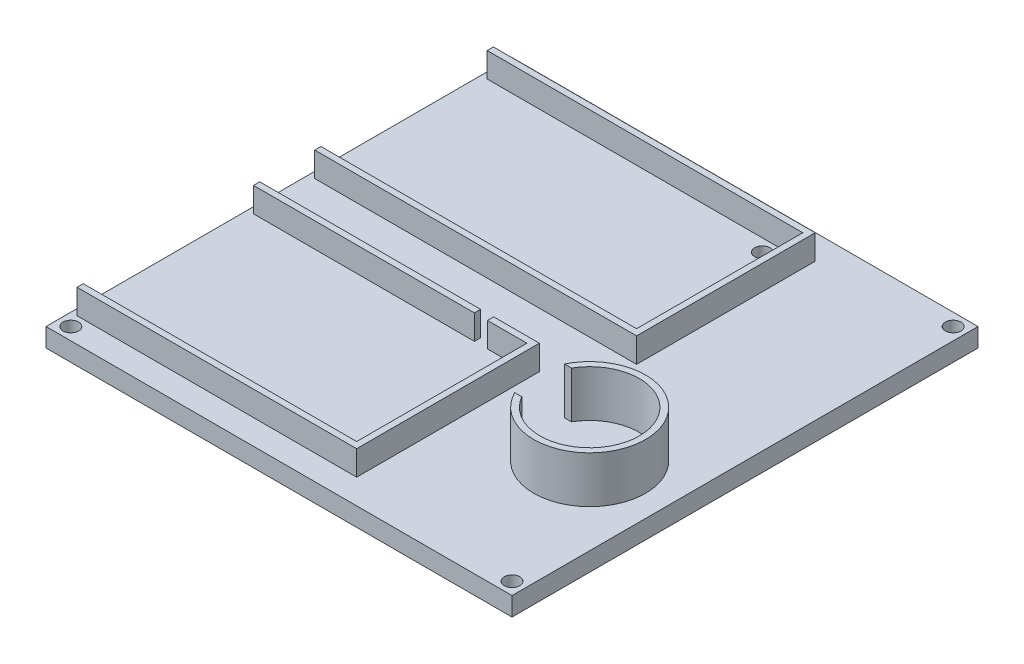
ISO-10303-21;
HEADER;
FILE_DESCRIPTION(('STEP AP214'),'2;1');
FILE_NAME('part.step','',(''),(''),'','','');
FILE_SCHEMA(('AUTOMOTIVE_DESIGN { 1 0 10303 214 1 1 1 1 }'));
ENDSEC;
DATA;
#1=APPLICATION_CONTEXT('core data for automotive mechanical design processes');
#2=APPLICATION_PROTOCOL_DEFINITION('international standard','automotive_design',2000,#1);
#3=PRODUCT_CONTEXT('',#1,'mechanical');
#4=PRODUCT('Part','Part','',(#3));
#5=PRODUCT_RELATED_PRODUCT_CATEGORY('part','',(#4));
#6=PRODUCT_DEFINITION_FORMATION('','',#4);
#7=PRODUCT_DEFINITION_CONTEXT('part definition',#1,'design');
#8=PRODUCT_DEFINITION('design','',#6,#7);
#9=PRODUCT_DEFINITION_SHAPE('','',#8);
#10=(LENGTH_UNIT() NAMED_UNIT(*) SI_UNIT(.MILLI.,.METRE.));
#11=(NAMED_UNIT(*) PLANE_ANGLE_UNIT() SI_UNIT($,.RADIAN.));
#12=(NAMED_UNIT(*) SI_UNIT($,.STERADIAN.) SOLID_ANGLE_UNIT());
#13=UNCERTAINTY_MEASURE_WITH_UNIT(LENGTH_MEASURE(1.E-05),#10,'distance_accuracy_value','');
#14=(GEOMETRIC_REPRESENTATION_CONTEXT(3) GLOBAL_UNCERTAINTY_ASSIGNED_CONTEXT((#13)) GLOBAL_UNIT_ASSIGNED_CONTEXT((#10,
#11,#12)) REPRESENTATION_CONTEXT('',''));
#15=CARTESIAN_POINT('',(0.,0.,0.));
#16=DIRECTION('',(0.,0.,1.));
#17=DIRECTION('',(1.,0.,0.));
#18=AXIS2_PLACEMENT_3D('',#15,#16,#17);
#19=CARTESIAN_POINT('',(50.,13.94,25.));
#20=DIRECTION('',(0.,-1.,0.));
#21=DIRECTION('',(0.,0.,-1.));
#22=AXIS2_PLACEMENT_3D('',#19,#20,#21);
#23=CYLINDRICAL_SURFACE('',#22,18.);
#24=DIRECTION('',(0.,1.,0.));
#25=VECTOR('',#24,1.);
#26=CARTESIAN_POINT('',(33.8754845034029,-10.5278361384715,17.));
#27=LINE('',#26,#25);
#28=CARTESIAN_POINT('',(33.8754845034029,6.,17.));
#29=VERTEX_POINT('',#28);
#30=CARTESIAN_POINT('',(33.8754845034029,21.,17.));
#31=VERTEX_POINT('',#30);
#32=EDGE_CURVE('E295',#29,#31,#27,.T.);
#33=ORIENTED_EDGE('',*,*,#32,.T.);
#34=CARTESIAN_POINT('',(50.,21.,25.));
#35=DIRECTION('',(0.,1.,0.));
#36=DIRECTION('',(0.,0.,1.));
#37=AXIS2_PLACEMENT_3D('',#34,#35,#36);
#38=CIRCLE('',#37,18.);
#39=CARTESIAN_POINT('',(33.8754845034029,21.,33.));
#40=VERTEX_POINT('',#39);
#41=EDGE_CURVE('E288',#40,#31,#38,.T.);
#42=ORIENTED_EDGE('',*,*,#41,.F.);
#43=DIRECTION('',(0.,1.,0.));
#44=VECTOR('',#43,1.);
#45=CARTESIAN_POINT('',(33.8754845034029,-10.5278361384715,33.));
#46=LINE('',#45,#44);
#47=CARTESIAN_POINT('',(33.8754845034029,6.,33.));
#48=VERTEX_POINT('',#47);
#49=EDGE_CURVE('E271',#48,#40,#46,.T.);
#50=ORIENTED_EDGE('',*,*,#49,.F.);
#51=CARTESIAN_POINT('',(50.,6.,25.));
#52=DIRECTION('',(0.,1.,0.));
#53=DIRECTION('',(0.,0.,1.));
#54=AXIS2_PLACEMENT_3D('',#51,#52,#53);
#55=CIRCLE('',#54,18.);
#56=EDGE_CURVE('E297',#48,#29,#55,.T.);
#57=ORIENTED_EDGE('',*,*,#56,.T.);
#58=EDGE_LOOP('',(#33,#42,#50,#57));
#59=FACE_BOUND('',#58,.T.);
#60=ADVANCED_FACE('F83',(#59),#23,.T.);
#61=CARTESIAN_POINT('',(50.,21.,25.));
#62=DIRECTION('',(0.,1.,0.));
#63=DIRECTION('',(0.,0.,1.));
#64=AXIS2_PLACEMENT_3D('',#61,#62,#63);
#65=PLANE('',#64);
#66=ORIENTED_EDGE('',*,*,#41,.T.);
#67=DIRECTION('',(1.,0.,0.));
#68=VECTOR('',#67,1.);
#69=CARTESIAN_POINT('',(0.,21.,17.));
#70=LINE('',#69,#68);
#71=CARTESIAN_POINT('',(36.143593539449,21.,17.));
#72=VERTEX_POINT('',#71);
#73=EDGE_CURVE('E281',#31,#72,#70,.T.);
#74=ORIENTED_EDGE('',*,*,#73,.T.);
#75=CARTESIAN_POINT('',(50.,21.,25.));
#76=DIRECTION('',(0.,1.,0.));
#77=DIRECTION('',(0.,0.,1.));
#78=AXIS2_PLACEMENT_3D('',#75,#76,#77);
#79=CIRCLE('',#78,16.);
#80=CARTESIAN_POINT('',(36.143593539449,21.,33.));
#81=VERTEX_POINT('',#80);
#82=EDGE_CURVE('E290',#81,#72,#79,.T.);
#83=ORIENTED_EDGE('',*,*,#82,.F.);
#84=DIRECTION('',(1.,0.,0.));
#85=VECTOR('',#84,1.);
#86=CARTESIAN_POINT('',(0.,21.,33.));
#87=LINE('',#86,#85);
#88=EDGE_CURVE('E274',#40,#81,#87,.T.);
#89=ORIENTED_EDGE('',*,*,#88,.F.);
#90=EDGE_LOOP('',(#66,#74,#83,#89));
#91=FACE_BOUND('',#90,.T.);
#92=ADVANCED_FACE('F286',(#91),#65,.T.);
#93=CARTESIAN_POINT('',(50.,13.94,25.));
#94=DIRECTION('',(0.,-1.,0.));
#95=DIRECTION('',(0.,0.,-1.));
#96=AXIS2_PLACEMENT_3D('',#93,#94,#95);
#97=CYLINDRICAL_SURFACE('',#96,16.);
#98=ORIENTED_EDGE('',*,*,#82,.T.);
#99=DIRECTION('',(0.,1.,0.));
#100=VECTOR('',#99,1.);
#101=CARTESIAN_POINT('',(36.143593539449,-10.5278361384715,17.));
#102=LINE('',#101,#100);
#103=CARTESIAN_POINT('',(36.143593539449,6.,17.));
#104=VERTEX_POINT('',#103);
#105=EDGE_CURVE('E924',#104,#72,#102,.T.);
#106=ORIENTED_EDGE('',*,*,#105,.F.);
#107=CARTESIAN_POINT('',(50.,6.,25.));
#108=DIRECTION('',(0.,1.,0.));
#109=DIRECTION('',(0.,0.,1.));
#110=AXIS2_PLACEMENT_3D('',#107,#108,#109);
#111=CIRCLE('',#110,16.);
#112=CARTESIAN_POINT('',(36.143593539449,6.,33.));
#113=VERTEX_POINT('',#112);
#114=EDGE_CURVE('E12',#104,#113,#111,.F.);
#115=ORIENTED_EDGE('',*,*,#114,.T.);
#116=DIRECTION('',(0.,1.,0.));
#117=VECTOR('',#116,1.);
#118=CARTESIAN_POINT('',(36.143593539449,-10.5278361384715,33.));
#119=LINE('',#118,#117);
#120=EDGE_CURVE('E280',#113,#81,#119,.T.);
#121=ORIENTED_EDGE('',*,*,#120,.T.);
#122=EDGE_LOOP('',(#98,#106,#115,#121));
#123=FACE_BOUND('',#122,.T.);
#124=ADVANCED_FACE('F596',(#123),#97,.F.);
#125=CARTESIAN_POINT('',(-75.,6.,-75.));
#126=DIRECTION('',(1.,0.,0.));
#127=DIRECTION('',(0.,0.,-1.));
#128=AXIS2_PLACEMENT_3D('',#125,#126,#127);
#129=PLANE('',#128);
#130=DIRECTION('',(0.,0.,1.));
#131=VECTOR('',#130,1.);
#132=CARTESIAN_POINT('',(-75.,0.,-75.));
#133=LINE('',#132,#131);
#134=CARTESIAN_POINT('',(-75.,0.,-75.));
#135=VERTEX_POINT('',#134);
#136=CARTESIAN_POINT('',(-75.,0.,75.));
#137=VERTEX_POINT('',#136);
#138=EDGE_CURVE('E514',#135,#137,#133,.T.);
#139=ORIENTED_EDGE('',*,*,#138,.T.);
#140=DIRECTION('',(0.,-1.,0.));
#141=VECTOR('',#140,1.);
#142=CARTESIAN_POINT('',(-75.,6.,75.));
#143=LINE('',#142,#141);
#144=CARTESIAN_POINT('',(-75.,6.,75.));
#145=VERTEX_POINT('',#144);
#146=EDGE_CURVE('E92',#145,#137,#143,.T.);
#147=ORIENTED_EDGE('',*,*,#146,.F.);
#148=DIRECTION('',(0.,0.,1.));
#149=VECTOR('',#148,1.);
#150=CARTESIAN_POINT('',(-75.,6.,-75.));
#151=LINE('',#150,#149);
#152=CARTESIAN_POINT('',(-75.,6.,-75.));
#153=VERTEX_POINT('',#152);
#154=EDGE_CURVE('E515',#153,#145,#151,.T.);
#155=ORIENTED_EDGE('',*,*,#154,.F.);
#156=DIRECTION('',(0.,-1.,0.));
#157=VECTOR('',#156,1.);
#158=CARTESIAN_POINT('',(-75.,6.,-75.));
#159=LINE('',#158,#157);
#160=EDGE_CURVE('E529',#153,#135,#159,.T.);
#161=ORIENTED_EDGE('',*,*,#160,.T.);
#162=EDGE_LOOP('',(#139,#147,#155,#161));
#163=FACE_BOUND('',#162,.T.);
#164=ADVANCED_FACE('F85',(#163),#129,.F.);
#165=CARTESIAN_POINT('',(-75.,6.,75.));
#166=DIRECTION('',(0.,0.,-1.));
#167=DIRECTION('',(-1.,0.,0.));
#168=AXIS2_PLACEMENT_3D('',#165,#166,#167);
#169=PLANE('',#168);
#170=DIRECTION('',(1.,0.,0.));
#171=VECTOR('',#170,1.);
#172=CARTESIAN_POINT('',(-75.,0.,75.));
#173=LINE('',#172,#171);
#174=CARTESIAN_POINT('',(75.,0.,75.));
#175=VERTEX_POINT('',#174);
#176=EDGE_CURVE('E533',#137,#175,#173,.T.);
#177=ORIENTED_EDGE('',*,*,#176,.T.);
#178=DIRECTION('',(0.,-1.,0.));
#179=VECTOR('',#178,1.);
#180=CARTESIAN_POINT('',(75.,6.,75.));
#181=LINE('',#180,#179);
#182=CARTESIAN_POINT('',(75.,6.,75.));
#183=VERTEX_POINT('',#182);
#184=EDGE_CURVE('E548',#183,#175,#181,.T.);
#185=ORIENTED_EDGE('',*,*,#184,.F.);
#186=DIRECTION('',(1.,0.,0.));
#187=VECTOR('',#186,1.);
#188=CARTESIAN_POINT('',(-75.,6.,75.));
#189=LINE('',#188,#187);
#190=EDGE_CURVE('E519',#145,#183,#189,.T.);
#191=ORIENTED_EDGE('',*,*,#190,.F.);
#192=ORIENTED_EDGE('',*,*,#146,.T.);
#193=EDGE_LOOP('',(#177,#185,#191,#192));
#194=FACE_BOUND('',#193,.T.);
#195=ADVANCED_FACE('F555',(#194),#169,.F.);
#196=CARTESIAN_POINT('',(75.,6.,-75.));
#197=DIRECTION('',(-1.,0.,0.));
#198=DIRECTION('',(0.,0.,1.));
#199=AXIS2_PLACEMENT_3D('',#196,#197,#198);
#200=PLANE('',#199);
#201=DIRECTION('',(0.,0.,-1.));
#202=VECTOR('',#201,1.);
#203=CARTESIAN_POINT('',(75.,0.,-75.));
#204=LINE('',#203,#202);
#205=CARTESIAN_POINT('',(75.,0.,-75.));
#206=VERTEX_POINT('',#205);
#207=EDGE_CURVE('E536',#175,#206,#204,.T.);
#208=ORIENTED_EDGE('',*,*,#207,.T.);
#209=DIRECTION('',(0.,-1.,0.));
#210=VECTOR('',#209,1.);
#211=CARTESIAN_POINT('',(75.,6.,-75.));
#212=LINE('',#211,#210);
#213=CARTESIAN_POINT('',(75.,6.,-75.));
#214=VERTEX_POINT('',#213);
#215=EDGE_CURVE('E544',#214,#206,#212,.T.);
#216=ORIENTED_EDGE('',*,*,#215,.F.);
#217=DIRECTION('',(0.,0.,-1.));
#218=VECTOR('',#217,1.);
#219=CARTESIAN_POINT('',(75.,6.,-75.));
#220=LINE('',#219,#218);
#221=EDGE_CURVE('E523',#183,#214,#220,.T.);
#222=ORIENTED_EDGE('',*,*,#221,.F.);
#223=ORIENTED_EDGE('',*,*,#184,.T.);
#224=EDGE_LOOP('',(#208,#216,#222,#223));
#225=FACE_BOUND('',#224,.T.);
#226=ADVANCED_FACE('F567',(#225),#200,.F.);
#227=CARTESIAN_POINT('',(-75.,6.,-75.));
#228=DIRECTION('',(0.,0.,1.));
#229=DIRECTION('',(1.,0.,0.));
#230=AXIS2_PLACEMENT_3D('',#227,#228,#229);
#231=PLANE('',#230);
#232=DIRECTION('',(-1.,0.,0.));
#233=VECTOR('',#232,1.);
#234=CARTESIAN_POINT('',(-75.,0.,-75.));
#235=LINE('',#234,#233);
#236=EDGE_CURVE('E520',#206,#135,#235,.T.);
#237=ORIENTED_EDGE('',*,*,#236,.T.);
#238=ORIENTED_EDGE('',*,*,#160,.F.);
#239=DIRECTION('',(-1.,0.,0.));
#240=VECTOR('',#239,1.);
#241=CARTESIAN_POINT('',(-75.,6.,-75.));
#242=LINE('',#241,#240);
#243=EDGE_CURVE('E526',#214,#153,#242,.T.);
#244=ORIENTED_EDGE('',*,*,#243,.F.);
#245=ORIENTED_EDGE('',*,*,#215,.T.);
#246=EDGE_LOOP('',(#237,#238,#244,#245));
#247=FACE_BOUND('',#246,.T.);
#248=ADVANCED_FACE('F571',(#247),#231,.F.);
#249=CARTESIAN_POINT('',(0.,6.,0.));
#250=DIRECTION('',(0.,1.,0.));
#251=DIRECTION('',(0.,0.,1.));
#252=AXIS2_PLACEMENT_3D('',#249,#250,#251);
#253=PLANE('',#252);
#254=CARTESIAN_POINT('',(-71.,6.,71.));
#255=DIRECTION('',(0.,1.,0.));
#256=DIRECTION('',(0.,0.,-1.));
#257=AXIS2_PLACEMENT_3D('',#254,#255,#256);
#258=CIRCLE('',#257,2.5);
#259=CARTESIAN_POINT('',(-71.,6.,68.5));
#260=VERTEX_POINT('',#259);
#261=EDGE_CURVE('E970',#260,#260,#258,.T.);
#262=ORIENTED_EDGE('',*,*,#261,.F.);
#263=EDGE_LOOP('',(#262));
#264=FACE_BOUND('',#263,.T.);
#265=CARTESIAN_POINT('',(71.,6.,71.));
#266=DIRECTION('',(0.,1.,0.));
#267=DIRECTION('',(0.,0.,1.));
#268=AXIS2_PLACEMENT_3D('',#265,#266,#267);
#269=CIRCLE('',#268,2.5);
#270=CARTESIAN_POINT('',(71.,6.,73.5));
#271=VERTEX_POINT('',#270);
#272=EDGE_CURVE('E962',#271,#271,#269,.T.);
#273=ORIENTED_EDGE('',*,*,#272,.F.);
#274=EDGE_LOOP('',(#273));
#275=FACE_BOUND('',#274,.T.);
#276=CARTESIAN_POINT('',(24.6,6.,-15.5));
#277=DIRECTION('',(0.,1.,0.));
#278=DIRECTION('',(0.,0.,1.));
#279=AXIS2_PLACEMENT_3D('',#276,#277,#278);
#280=CIRCLE('',#279,2.5);
#281=CARTESIAN_POINT('',(24.6,6.,-13.));
#282=VERTEX_POINT('',#281);
#283=EDGE_CURVE('E954',#282,#282,#280,.T.);
#284=ORIENTED_EDGE('',*,*,#283,.F.);
#285=EDGE_LOOP('',(#284));
#286=FACE_BOUND('',#285,.T.);
#287=CARTESIAN_POINT('',(19.6,6.,-61.));
#288=DIRECTION('',(0.,1.,0.));
#289=DIRECTION('',(0.,0.,1.));
#290=AXIS2_PLACEMENT_3D('',#287,#288,#289);
#291=CIRCLE('',#290,2.5);
#292=CARTESIAN_POINT('',(19.6,6.,-58.5));
#293=VERTEX_POINT('',#292);
#294=EDGE_CURVE('E946',#293,#293,#291,.T.);
#295=ORIENTED_EDGE('',*,*,#294,.F.);
#296=EDGE_LOOP('',(#295));
#297=FACE_BOUND('',#296,.T.);
#298=CARTESIAN_POINT('',(71.,6.,-71.));
#299=DIRECTION('',(0.,1.,0.));
#300=DIRECTION('',(0.,0.,-1.));
#301=AXIS2_PLACEMENT_3D('',#298,#299,#300);
#302=CIRCLE('',#301,2.5);
#303=CARTESIAN_POINT('',(71.,6.,-73.5));
#304=VERTEX_POINT('',#303);
#305=EDGE_CURVE('E937',#304,#304,#302,.T.);
#306=ORIENTED_EDGE('',*,*,#305,.F.);
#307=EDGE_LOOP('',(#306));
#308=FACE_BOUND('',#307,.T.);
#309=CARTESIAN_POINT('',(-71.,6.,-71.));
#310=DIRECTION('',(0.,1.,0.));
#311=DIRECTION('',(0.,0.,1.));
#312=AXIS2_PLACEMENT_3D('',#309,#310,#311);
#313=CIRCLE('',#312,2.5);
#314=CARTESIAN_POINT('',(-71.,6.,-68.5));
#315=VERTEX_POINT('',#314);
#316=EDGE_CURVE('E941',#315,#315,#313,.T.);
#317=ORIENTED_EDGE('',*,*,#316,.F.);
#318=EDGE_LOOP('',(#317));
#319=FACE_BOUND('',#318,.T.);
#320=ORIENTED_EDGE('',*,*,#56,.F.);
#321=DIRECTION('',(-1.,0.,0.));
#322=VECTOR('',#321,1.);
#323=CARTESIAN_POINT('',(0.,6.,33.));
#324=LINE('',#323,#322);
#325=EDGE_CURVE('E99',#113,#48,#324,.T.);
#326=ORIENTED_EDGE('',*,*,#325,.F.);
#327=ORIENTED_EDGE('',*,*,#114,.F.);
#328=DIRECTION('',(-1.,0.,0.));
#329=VECTOR('',#328,1.);
#330=CARTESIAN_POINT('',(0.,6.,17.));
#331=LINE('',#330,#329);
#332=EDGE_CURVE('E925',#104,#29,#331,.T.);
#333=ORIENTED_EDGE('',*,*,#332,.T.);
#334=EDGE_LOOP('',(#320,#326,#327,#333));
#335=FACE_BOUND('',#334,.T.);
#336=DIRECTION('',(1.,0.,0.));
#337=VECTOR('',#336,1.);
#338=CARTESIAN_POINT('',(0.,6.,65.));
#339=LINE('',#338,#337);
#340=CARTESIAN_POINT('',(-73.,6.,65.));
#341=VERTEX_POINT('',#340);
#342=CARTESIAN_POINT('',(15.,6.,65.));
#343=VERTEX_POINT('',#342);
#344=EDGE_CURVE('E301',#341,#343,#339,.T.);
#345=ORIENTED_EDGE('',*,*,#344,.T.);
#346=DIRECTION('',(0.,0.,1.));
#347=VECTOR('',#346,1.);
#348=CARTESIAN_POINT('',(15.,6.,0.));
#349=LINE('',#348,#347);
#350=CARTESIAN_POINT('',(15.,6.,10.2));
#351=VERTEX_POINT('',#350);
#352=EDGE_CURVE('E312',#351,#343,#349,.T.);
#353=ORIENTED_EDGE('',*,*,#352,.F.);
#354=DIRECTION('',(1.,0.,0.));
#355=VECTOR('',#354,1.);
#356=CARTESIAN_POINT('',(0.,6.,10.2));
#357=LINE('',#356,#355);
#358=CARTESIAN_POINT('',(2.29999999999998,6.,10.2));
#359=VERTEX_POINT('',#358);
#360=EDGE_CURVE('E359',#359,#351,#357,.T.);
#361=ORIENTED_EDGE('',*,*,#360,.F.);
#362=DIRECTION('',(0.,0.,-1.));
#363=VECTOR('',#362,1.);
#364=CARTESIAN_POINT('',(2.29999999999998,6.,0.));
#365=LINE('',#364,#363);
#366=CARTESIAN_POINT('',(2.29999999999998,6.,8.20000000000002));
#367=VERTEX_POINT('',#366);
#368=EDGE_CURVE('E355',#359,#367,#365,.T.);
#369=ORIENTED_EDGE('',*,*,#368,.T.);
#370=DIRECTION('',(1.,0.,0.));
#371=VECTOR('',#370,1.);
#372=CARTESIAN_POINT('',(0.,6.,8.20000000000002));
#373=LINE('',#372,#371);
#374=CARTESIAN_POINT('',(17.,6.,8.20000000000002));
#375=VERTEX_POINT('',#374);
#376=EDGE_CURVE('E351',#367,#375,#373,.T.);
#377=ORIENTED_EDGE('',*,*,#376,.T.);
#378=DIRECTION('',(0.,0.,1.));
#379=VECTOR('',#378,1.);
#380=CARTESIAN_POINT('',(17.,6.,0.));
#381=LINE('',#380,#379);
#382=CARTESIAN_POINT('',(17.,6.,67.));
#383=VERTEX_POINT('',#382);
#384=EDGE_CURVE('E347',#375,#383,#381,.T.);
#385=ORIENTED_EDGE('',*,*,#384,.T.);
#386=DIRECTION('',(1.,0.,0.));
#387=VECTOR('',#386,1.);
#388=CARTESIAN_POINT('',(0.,6.,67.));
#389=LINE('',#388,#387);
#390=CARTESIAN_POINT('',(-73.,6.,67.));
#391=VERTEX_POINT('',#390);
#392=EDGE_CURVE('E343',#391,#383,#389,.T.);
#393=ORIENTED_EDGE('',*,*,#392,.F.);
#394=DIRECTION('',(0.,0.,1.));
#395=VECTOR('',#394,1.);
#396=CARTESIAN_POINT('',(-73.,6.,0.));
#397=LINE('',#396,#395);
#398=EDGE_CURVE('E340',#341,#391,#397,.T.);
#399=ORIENTED_EDGE('',*,*,#398,.F.);
#400=EDGE_LOOP('',(#345,#353,#361,#369,#377,#385,#393,#399));
#401=FACE_BOUND('',#400,.T.);
#402=DIRECTION('',(1.,0.,0.));
#403=VECTOR('',#402,1.);
#404=CARTESIAN_POINT('',(0.,6.,8.20000000000002));
#405=LINE('',#404,#403);
#406=CARTESIAN_POINT('',(-73.,6.,8.20000000000003));
#407=VERTEX_POINT('',#406);
#408=CARTESIAN_POINT('',(-1.92000000000002,6.,8.20000000000002));
#409=VERTEX_POINT('',#408);
#410=EDGE_CURVE('E387',#407,#409,#405,.T.);
#411=ORIENTED_EDGE('',*,*,#410,.T.);
#412=DIRECTION('',(0.,0.,1.));
#413=VECTOR('',#412,1.);
#414=CARTESIAN_POINT('',(-1.92000000000002,6.,0.));
#415=LINE('',#414,#413);
#416=CARTESIAN_POINT('',(-1.92000000000002,6.,10.2));
#417=VERTEX_POINT('',#416);
#418=EDGE_CURVE('E393',#409,#417,#415,.T.);
#419=ORIENTED_EDGE('',*,*,#418,.T.);
#420=DIRECTION('',(1.,0.,0.));
#421=VECTOR('',#420,1.);
#422=CARTESIAN_POINT('',(0.,6.,10.2));
#423=LINE('',#422,#421);
#424=CARTESIAN_POINT('',(-73.,6.,10.2));
#425=VERTEX_POINT('',#424);
#426=EDGE_CURVE('E410',#425,#417,#423,.T.);
#427=ORIENTED_EDGE('',*,*,#426,.F.);
#428=DIRECTION('',(0.,0.,1.));
#429=VECTOR('',#428,1.);
#430=CARTESIAN_POINT('',(-73.,6.,0.));
#431=LINE('',#430,#429);
#432=EDGE_CURVE('E406',#407,#425,#431,.T.);
#433=ORIENTED_EDGE('',*,*,#432,.F.);
#434=EDGE_LOOP('',(#411,#419,#427,#433));
#435=FACE_BOUND('',#434,.T.);
#436=DIRECTION('',(1.,0.,0.));
#437=VECTOR('',#436,1.);
#438=CARTESIAN_POINT('',(0.,6.,-67.));
#439=LINE('',#438,#437);
#440=CARTESIAN_POINT('',(-73.,6.,-67.));
#441=VERTEX_POINT('',#440);
#442=CARTESIAN_POINT('',(30.6,6.,-67.));
#443=VERTEX_POINT('',#442);
#444=EDGE_CURVE('E431',#441,#443,#439,.T.);
#445=ORIENTED_EDGE('',*,*,#444,.T.);
#446=DIRECTION('',(0.,0.,1.));
#447=VECTOR('',#446,1.);
#448=CARTESIAN_POINT('',(30.6,6.,0.));
#449=LINE('',#448,#447);
#450=CARTESIAN_POINT('',(30.6,6.,-9.5));
#451=VERTEX_POINT('',#450);
#452=EDGE_CURVE('E437',#443,#451,#449,.T.);
#453=ORIENTED_EDGE('',*,*,#452,.T.);
#454=DIRECTION('',(1.,0.,0.));
#455=VECTOR('',#454,1.);
#456=CARTESIAN_POINT('',(0.,6.,-9.5));
#457=LINE('',#456,#455);
#458=CARTESIAN_POINT('',(-73.,6.,-9.5));
#459=VERTEX_POINT('',#458);
#460=EDGE_CURVE('E477',#459,#451,#457,.T.);
#461=ORIENTED_EDGE('',*,*,#460,.F.);
#462=DIRECTION('',(0.,0.,1.));
#463=VECTOR('',#462,1.);
#464=CARTESIAN_POINT('',(-73.,6.,0.));
#465=LINE('',#464,#463);
#466=CARTESIAN_POINT('',(-73.,6.,-11.5));
#467=VERTEX_POINT('',#466);
#468=EDGE_CURVE('E466',#467,#459,#465,.T.);
#469=ORIENTED_EDGE('',*,*,#468,.F.);
#470=DIRECTION('',(1.,0.,0.));
#471=VECTOR('',#470,1.);
#472=CARTESIAN_POINT('',(0.,6.,-11.5));
#473=LINE('',#472,#471);
#474=CARTESIAN_POINT('',(28.6,6.,-11.5));
#475=VERTEX_POINT('',#474);
#476=EDGE_CURVE('E474',#467,#475,#473,.T.);
#477=ORIENTED_EDGE('',*,*,#476,.T.);
#478=DIRECTION('',(0.,0.,1.));
#479=VECTOR('',#478,1.);
#480=CARTESIAN_POINT('',(28.6,6.,0.));
#481=LINE('',#480,#479);
#482=CARTESIAN_POINT('',(28.6,6.,-65.));
#483=VERTEX_POINT('',#482);
#484=EDGE_CURVE('E470',#483,#475,#481,.T.);
#485=ORIENTED_EDGE('',*,*,#484,.F.);
#486=DIRECTION('',(1.,0.,0.));
#487=VECTOR('',#486,1.);
#488=CARTESIAN_POINT('',(0.,6.,-65.));
#489=LINE('',#488,#487);
#490=CARTESIAN_POINT('',(-73.,6.,-65.));
#491=VERTEX_POINT('',#490);
#492=EDGE_CURVE('E465',#491,#483,#489,.T.);
#493=ORIENTED_EDGE('',*,*,#492,.F.);
#494=EDGE_CURVE('E461',#441,#491,#465,.T.);
#495=ORIENTED_EDGE('',*,*,#494,.F.);
#496=EDGE_LOOP('',(#445,#453,#461,#469,#477,#485,#493,#495));
#497=FACE_BOUND('',#496,.T.);
#498=ORIENTED_EDGE('',*,*,#154,.T.);
#499=ORIENTED_EDGE('',*,*,#190,.T.);
#500=ORIENTED_EDGE('',*,*,#221,.T.);
#501=ORIENTED_EDGE('',*,*,#243,.T.);
#502=EDGE_LOOP('',(#498,#499,#500,#501));
#503=FACE_BOUND('',#502,.T.);
#504=ADVANCED_FACE('F573',(#264,#275,#286,#297,#308,#319,#335,#401,#435,#497,#503),#253,.T.);
#505=CARTESIAN_POINT('',(0.,0.,0.));
#506=DIRECTION('',(0.,1.,0.));
#507=DIRECTION('',(0.,0.,1.));
#508=AXIS2_PLACEMENT_3D('',#505,#506,#507);
#509=PLANE('',#508);
#510=CARTESIAN_POINT('',(-71.,0.,71.));
#511=DIRECTION('',(0.,1.,0.));
#512=DIRECTION('',(0.,0.,-1.));
#513=AXIS2_PLACEMENT_3D('',#510,#511,#512);
#514=CIRCLE('',#513,2.5);
#515=CARTESIAN_POINT('',(-71.,0.,68.5));
#516=VERTEX_POINT('',#515);
#517=EDGE_CURVE('E936',#516,#516,#514,.T.);
#518=ORIENTED_EDGE('',*,*,#517,.T.);
#519=EDGE_LOOP('',(#518));
#520=FACE_BOUND('',#519,.T.);
#521=CARTESIAN_POINT('',(71.,0.,71.));
#522=DIRECTION('',(0.,1.,0.));
#523=DIRECTION('',(0.,0.,1.));
#524=AXIS2_PLACEMENT_3D('',#521,#522,#523);
#525=CIRCLE('',#524,2.5);
#526=CARTESIAN_POINT('',(71.,0.,73.5));
#527=VERTEX_POINT('',#526);
#528=EDGE_CURVE('E966',#527,#527,#525,.T.);
#529=ORIENTED_EDGE('',*,*,#528,.T.);
#530=EDGE_LOOP('',(#529));
#531=FACE_BOUND('',#530,.T.);
#532=CARTESIAN_POINT('',(24.6,0.,-15.5));
#533=DIRECTION('',(0.,1.,0.));
#534=DIRECTION('',(0.,0.,1.));
#535=AXIS2_PLACEMENT_3D('',#532,#533,#534);
#536=CIRCLE('',#535,2.5);
#537=CARTESIAN_POINT('',(24.6,0.,-13.));
#538=VERTEX_POINT('',#537);
#539=EDGE_CURVE('E958',#538,#538,#536,.T.);
#540=ORIENTED_EDGE('',*,*,#539,.T.);
#541=EDGE_LOOP('',(#540));
#542=FACE_BOUND('',#541,.T.);
#543=CARTESIAN_POINT('',(19.6,0.,-61.));
#544=DIRECTION('',(0.,1.,0.));
#545=DIRECTION('',(0.,0.,1.));
#546=AXIS2_PLACEMENT_3D('',#543,#544,#545);
#547=CIRCLE('',#546,2.5);
#548=CARTESIAN_POINT('',(19.6,0.,-58.5));
#549=VERTEX_POINT('',#548);
#550=EDGE_CURVE('E950',#549,#549,#547,.T.);
#551=ORIENTED_EDGE('',*,*,#550,.T.);
#552=EDGE_LOOP('',(#551));
#553=FACE_BOUND('',#552,.T.);
#554=CARTESIAN_POINT('',(71.,0.,-71.));
#555=DIRECTION('',(0.,1.,0.));
#556=DIRECTION('',(0.,0.,-1.));
#557=AXIS2_PLACEMENT_3D('',#554,#555,#556);
#558=CIRCLE('',#557,2.5);
#559=CARTESIAN_POINT('',(71.,0.,-73.5));
#560=VERTEX_POINT('',#559);
#561=EDGE_CURVE('E942',#560,#560,#558,.T.);
#562=ORIENTED_EDGE('',*,*,#561,.T.);
#563=EDGE_LOOP('',(#562));
#564=FACE_BOUND('',#563,.T.);
#565=CARTESIAN_POINT('',(-71.,0.,-71.));
#566=DIRECTION('',(0.,1.,0.));
#567=DIRECTION('',(0.,0.,1.));
#568=AXIS2_PLACEMENT_3D('',#565,#566,#567);
#569=CIRCLE('',#568,2.5);
#570=CARTESIAN_POINT('',(-71.,0.,-68.5));
#571=VERTEX_POINT('',#570);
#572=EDGE_CURVE('E303',#571,#571,#569,.T.);
#573=ORIENTED_EDGE('',*,*,#572,.T.);
#574=EDGE_LOOP('',(#573));
#575=FACE_BOUND('',#574,.T.);
#576=ORIENTED_EDGE('',*,*,#138,.F.);
#577=ORIENTED_EDGE('',*,*,#236,.F.);
#578=ORIENTED_EDGE('',*,*,#207,.F.);
#579=ORIENTED_EDGE('',*,*,#176,.F.);
#580=EDGE_LOOP('',(#576,#577,#578,#579));
#581=FACE_BOUND('',#580,.T.);
#582=ADVANCED_FACE('F563',(#520,#531,#542,#553,#564,#575,#581),#509,.F.);
#583=CARTESIAN_POINT('',(0.,13.94,-67.));
#584=DIRECTION('',(0.,0.,-1.));
#585=DIRECTION('',(-1.,0.,0.));
#586=AXIS2_PLACEMENT_3D('',#583,#584,#585);
#587=PLANE('',#586);
#588=ORIENTED_EDGE('',*,*,#444,.F.);
#589=DIRECTION('',(0.,-1.,0.));
#590=VECTOR('',#589,1.);
#591=CARTESIAN_POINT('',(-73.,13.94,-67.));
#592=LINE('',#591,#590);
#593=CARTESIAN_POINT('',(-73.,13.94,-67.));
#594=VERTEX_POINT('',#593);
#595=EDGE_CURVE('E510',#594,#441,#592,.T.);
#596=ORIENTED_EDGE('',*,*,#595,.F.);
#597=DIRECTION('',(1.,0.,0.));
#598=VECTOR('',#597,1.);
#599=CARTESIAN_POINT('',(0.,13.94,-67.));
#600=LINE('',#599,#598);
#601=CARTESIAN_POINT('',(30.6,13.94,-67.));
#602=VERTEX_POINT('',#601);
#603=EDGE_CURVE('E432',#594,#602,#600,.T.);
#604=ORIENTED_EDGE('',*,*,#603,.T.);
#605=DIRECTION('',(0.,-1.,0.));
#606=VECTOR('',#605,1.);
#607=CARTESIAN_POINT('',(30.6,13.94,-67.));
#608=LINE('',#607,#606);
#609=EDGE_CURVE('E458',#602,#443,#608,.T.);
#610=ORIENTED_EDGE('',*,*,#609,.T.);
#611=EDGE_LOOP('',(#588,#596,#604,#610));
#612=FACE_BOUND('',#611,.T.);
#613=ADVANCED_FACE('F582',(#612),#587,.T.);
#614=CARTESIAN_POINT('',(-73.,13.94,0.));
#615=DIRECTION('',(1.,0.,0.));
#616=DIRECTION('',(0.,0.,-1.));
#617=AXIS2_PLACEMENT_3D('',#614,#615,#616);
#618=PLANE('',#617);
#619=ORIENTED_EDGE('',*,*,#494,.T.);
#620=DIRECTION('',(0.,-1.,0.));
#621=VECTOR('',#620,1.);
#622=CARTESIAN_POINT('',(-73.,13.94,-65.));
#623=LINE('',#622,#621);
#624=CARTESIAN_POINT('',(-73.,13.94,-65.));
#625=VERTEX_POINT('',#624);
#626=EDGE_CURVE('E506',#625,#491,#623,.T.);
#627=ORIENTED_EDGE('',*,*,#626,.F.);
#628=DIRECTION('',(0.,0.,1.));
#629=VECTOR('',#628,1.);
#630=CARTESIAN_POINT('',(-73.,13.94,0.));
#631=LINE('',#630,#629);
#632=EDGE_CURVE('E436',#594,#625,#631,.T.);
#633=ORIENTED_EDGE('',*,*,#632,.F.);
#634=ORIENTED_EDGE('',*,*,#595,.T.);
#635=EDGE_LOOP('',(#619,#627,#633,#634));
#636=FACE_BOUND('',#635,.T.);
#637=ADVANCED_FACE('F675',(#636),#618,.F.);
#638=CARTESIAN_POINT('',(0.,13.94,-65.));
#639=DIRECTION('',(0.,0.,-1.));
#640=DIRECTION('',(-1.,0.,0.));
#641=AXIS2_PLACEMENT_3D('',#638,#639,#640);
#642=PLANE('',#641);
#643=ORIENTED_EDGE('',*,*,#492,.T.);
#644=DIRECTION('',(0.,-1.,0.));
#645=VECTOR('',#644,1.);
#646=CARTESIAN_POINT('',(28.6,13.94,-65.));
#647=LINE('',#646,#645);
#648=CARTESIAN_POINT('',(28.6,13.94,-65.));
#649=VERTEX_POINT('',#648);
#650=EDGE_CURVE('E502',#649,#483,#647,.T.);
#651=ORIENTED_EDGE('',*,*,#650,.F.);
#652=DIRECTION('',(1.,0.,0.));
#653=VECTOR('',#652,1.);
#654=CARTESIAN_POINT('',(0.,13.94,-65.));
#655=LINE('',#654,#653);
#656=EDGE_CURVE('E440',#625,#649,#655,.T.);
#657=ORIENTED_EDGE('',*,*,#656,.F.);
#658=ORIENTED_EDGE('',*,*,#626,.T.);
#659=EDGE_LOOP('',(#643,#651,#657,#658));
#660=FACE_BOUND('',#659,.T.);
#661=ADVANCED_FACE('F682',(#660),#642,.F.);
#662=CARTESIAN_POINT('',(28.6,13.94,0.));
#663=DIRECTION('',(1.,0.,0.));
#664=DIRECTION('',(0.,0.,-1.));
#665=AXIS2_PLACEMENT_3D('',#662,#663,#664);
#666=PLANE('',#665);
#667=ORIENTED_EDGE('',*,*,#484,.T.);
#668=DIRECTION('',(0.,-1.,0.));
#669=VECTOR('',#668,1.);
#670=CARTESIAN_POINT('',(28.6,13.94,-11.5));
#671=LINE('',#670,#669);
#672=CARTESIAN_POINT('',(28.6,13.94,-11.5));
#673=VERTEX_POINT('',#672);
#674=EDGE_CURVE('E498',#673,#475,#671,.T.);
#675=ORIENTED_EDGE('',*,*,#674,.F.);
#676=DIRECTION('',(0.,0.,1.));
#677=VECTOR('',#676,1.);
#678=CARTESIAN_POINT('',(28.6,13.94,0.));
#679=LINE('',#678,#677);
#680=EDGE_CURVE('E444',#649,#673,#679,.T.);
#681=ORIENTED_EDGE('',*,*,#680,.F.);
#682=ORIENTED_EDGE('',*,*,#650,.T.);
#683=EDGE_LOOP('',(#667,#675,#681,#682));
#684=FACE_BOUND('',#683,.T.);
#685=ADVANCED_FACE('F678',(#684),#666,.F.);
#686=CARTESIAN_POINT('',(0.,13.94,-11.5));
#687=DIRECTION('',(0.,0.,-1.));
#688=DIRECTION('',(-1.,0.,0.));
#689=AXIS2_PLACEMENT_3D('',#686,#687,#688);
#690=PLANE('',#689);
#691=ORIENTED_EDGE('',*,*,#476,.F.);
#692=DIRECTION('',(0.,-1.,0.));
#693=VECTOR('',#692,1.);
#694=CARTESIAN_POINT('',(-73.,13.94,-11.5));
#695=LINE('',#694,#693);
#696=CARTESIAN_POINT('',(-73.,13.94,-11.5));
#697=VERTEX_POINT('',#696);
#698=EDGE_CURVE('E494',#697,#467,#695,.T.);
#699=ORIENTED_EDGE('',*,*,#698,.F.);
#700=DIRECTION('',(1.,0.,0.));
#701=VECTOR('',#700,1.);
#702=CARTESIAN_POINT('',(0.,13.94,-11.5));
#703=LINE('',#702,#701);
#704=EDGE_CURVE('E447',#697,#673,#703,.T.);
#705=ORIENTED_EDGE('',*,*,#704,.T.);
#706=ORIENTED_EDGE('',*,*,#674,.T.);
#707=EDGE_LOOP('',(#691,#699,#705,#706));
#708=FACE_BOUND('',#707,.T.);
#709=ADVANCED_FACE('F673',(#708),#690,.T.);
#710=ORIENTED_EDGE('',*,*,#468,.T.);
#711=DIRECTION('',(0.,-1.,0.));
#712=VECTOR('',#711,1.);
#713=CARTESIAN_POINT('',(-73.,13.94,-9.5));
#714=LINE('',#713,#712);
#715=CARTESIAN_POINT('',(-73.,13.94,-9.5));
#716=VERTEX_POINT('',#715);
#717=EDGE_CURVE('E490',#716,#459,#714,.T.);
#718=ORIENTED_EDGE('',*,*,#717,.F.);
#719=EDGE_CURVE('E441',#697,#716,#631,.T.);
#720=ORIENTED_EDGE('',*,*,#719,.F.);
#721=ORIENTED_EDGE('',*,*,#698,.T.);
#722=EDGE_LOOP('',(#710,#718,#720,#721));
#723=FACE_BOUND('',#722,.T.);
#724=ADVANCED_FACE('F669',(#723),#618,.F.);
#725=CARTESIAN_POINT('',(0.,13.94,-9.5));
#726=DIRECTION('',(0.,0.,-1.));
#727=DIRECTION('',(-1.,0.,0.));
#728=AXIS2_PLACEMENT_3D('',#725,#726,#727);
#729=PLANE('',#728);
#730=ORIENTED_EDGE('',*,*,#460,.T.);
#731=DIRECTION('',(0.,-1.,0.));
#732=VECTOR('',#731,1.);
#733=CARTESIAN_POINT('',(30.6,13.94,-9.5));
#734=LINE('',#733,#732);
#735=CARTESIAN_POINT('',(30.6,13.94,-9.5));
#736=VERTEX_POINT('',#735);
#737=EDGE_CURVE('E486',#736,#451,#734,.T.);
#738=ORIENTED_EDGE('',*,*,#737,.F.);
#739=DIRECTION('',(1.,0.,0.));
#740=VECTOR('',#739,1.);
#741=CARTESIAN_POINT('',(0.,13.94,-9.5));
#742=LINE('',#741,#740);
#743=EDGE_CURVE('E451',#716,#736,#742,.T.);
#744=ORIENTED_EDGE('',*,*,#743,.F.);
#745=ORIENTED_EDGE('',*,*,#717,.T.);
#746=EDGE_LOOP('',(#730,#738,#744,#745));
#747=FACE_BOUND('',#746,.T.);
#748=ADVANCED_FACE('F665',(#747),#729,.F.);
#749=CARTESIAN_POINT('',(30.6,13.94,0.));
#750=DIRECTION('',(1.,0.,0.));
#751=DIRECTION('',(0.,0.,-1.));
#752=AXIS2_PLACEMENT_3D('',#749,#750,#751);
#753=PLANE('',#752);
#754=ORIENTED_EDGE('',*,*,#452,.F.);
#755=ORIENTED_EDGE('',*,*,#609,.F.);
#756=DIRECTION('',(0.,0.,1.));
#757=VECTOR('',#756,1.);
#758=CARTESIAN_POINT('',(30.6,13.94,0.));
#759=LINE('',#758,#757);
#760=EDGE_CURVE('E454',#602,#736,#759,.T.);
#761=ORIENTED_EDGE('',*,*,#760,.T.);
#762=ORIENTED_EDGE('',*,*,#737,.T.);
#763=EDGE_LOOP('',(#754,#755,#761,#762));
#764=FACE_BOUND('',#763,.T.);
#765=ADVANCED_FACE('F661',(#764),#753,.T.);
#766=CARTESIAN_POINT('',(0.,13.94,0.));
#767=DIRECTION('',(0.,1.,0.));
#768=DIRECTION('',(0.,0.,1.));
#769=AXIS2_PLACEMENT_3D('',#766,#767,#768);
#770=PLANE('',#769);
#771=ORIENTED_EDGE('',*,*,#603,.F.);
#772=ORIENTED_EDGE('',*,*,#632,.T.);
#773=ORIENTED_EDGE('',*,*,#656,.T.);
#774=ORIENTED_EDGE('',*,*,#680,.T.);
#775=ORIENTED_EDGE('',*,*,#704,.F.);
#776=ORIENTED_EDGE('',*,*,#719,.T.);
#777=ORIENTED_EDGE('',*,*,#743,.T.);
#778=ORIENTED_EDGE('',*,*,#760,.F.);
#779=EDGE_LOOP('',(#771,#772,#773,#774,#775,#776,#777,#778));
#780=FACE_BOUND('',#779,.T.);
#781=ADVANCED_FACE('F657',(#780),#770,.T.);
#782=CARTESIAN_POINT('',(0.,13.94,8.20000000000002));
#783=DIRECTION('',(0.,0.,-1.));
#784=DIRECTION('',(-1.,0.,0.));
#785=AXIS2_PLACEMENT_3D('',#782,#783,#784);
#786=PLANE('',#785);
#787=ORIENTED_EDGE('',*,*,#410,.F.);
#788=DIRECTION('',(0.,-1.,0.));
#789=VECTOR('',#788,1.);
#790=CARTESIAN_POINT('',(-73.,13.94,8.20000000000003));
#791=LINE('',#790,#789);
#792=CARTESIAN_POINT('',(-73.,13.94,8.20000000000003));
#793=VERTEX_POINT('',#792);
#794=EDGE_CURVE('E427',#793,#407,#791,.T.);
#795=ORIENTED_EDGE('',*,*,#794,.F.);
#796=DIRECTION('',(1.,0.,0.));
#797=VECTOR('',#796,1.);
#798=CARTESIAN_POINT('',(0.,13.94,8.20000000000002));
#799=LINE('',#798,#797);
#800=CARTESIAN_POINT('',(-1.92000000000002,13.94,8.20000000000002));
#801=VERTEX_POINT('',#800);
#802=EDGE_CURVE('E388',#793,#801,#799,.T.);
#803=ORIENTED_EDGE('',*,*,#802,.T.);
#804=DIRECTION('',(0.,-1.,0.));
#805=VECTOR('',#804,1.);
#806=CARTESIAN_POINT('',(-1.92000000000002,13.94,8.20000000000002));
#807=LINE('',#806,#805);
#808=EDGE_CURVE('E403',#801,#409,#807,.T.);
#809=ORIENTED_EDGE('',*,*,#808,.T.);
#810=EDGE_LOOP('',(#787,#795,#803,#809));
#811=FACE_BOUND('',#810,.T.);
#812=ADVANCED_FACE('F653',(#811),#786,.T.);
#813=CARTESIAN_POINT('',(-73.,13.94,0.));
#814=DIRECTION('',(1.,0.,0.));
#815=DIRECTION('',(0.,0.,-1.));
#816=AXIS2_PLACEMENT_3D('',#813,#814,#815);
#817=PLANE('',#816);
#818=ORIENTED_EDGE('',*,*,#432,.T.);
#819=DIRECTION('',(0.,-1.,0.));
#820=VECTOR('',#819,1.);
#821=CARTESIAN_POINT('',(-73.,13.94,10.2));
#822=LINE('',#821,#820);
#823=CARTESIAN_POINT('',(-73.,13.94,10.2));
#824=VERTEX_POINT('',#823);
#825=EDGE_CURVE('E423',#824,#425,#822,.T.);
#826=ORIENTED_EDGE('',*,*,#825,.F.);
#827=DIRECTION('',(0.,0.,1.));
#828=VECTOR('',#827,1.);
#829=CARTESIAN_POINT('',(-73.,13.94,0.));
#830=LINE('',#829,#828);
#831=EDGE_CURVE('E392',#793,#824,#830,.T.);
#832=ORIENTED_EDGE('',*,*,#831,.F.);
#833=ORIENTED_EDGE('',*,*,#794,.T.);
#834=EDGE_LOOP('',(#818,#826,#832,#833));
#835=FACE_BOUND('',#834,.T.);
#836=ADVANCED_FACE('F649',(#835),#817,.F.);
#837=CARTESIAN_POINT('',(0.,13.94,10.2));
#838=DIRECTION('',(0.,0.,-1.));
#839=DIRECTION('',(-1.,0.,0.));
#840=AXIS2_PLACEMENT_3D('',#837,#838,#839);
#841=PLANE('',#840);
#842=ORIENTED_EDGE('',*,*,#426,.T.);
#843=DIRECTION('',(0.,-1.,0.));
#844=VECTOR('',#843,1.);
#845=CARTESIAN_POINT('',(-1.92000000000002,13.94,10.2));
#846=LINE('',#845,#844);
#847=CARTESIAN_POINT('',(-1.92000000000002,13.94,10.2));
#848=VERTEX_POINT('',#847);
#849=EDGE_CURVE('E419',#848,#417,#846,.T.);
#850=ORIENTED_EDGE('',*,*,#849,.F.);
#851=DIRECTION('',(1.,0.,0.));
#852=VECTOR('',#851,1.);
#853=CARTESIAN_POINT('',(0.,13.94,10.2));
#854=LINE('',#853,#852);
#855=EDGE_CURVE('E396',#824,#848,#854,.T.);
#856=ORIENTED_EDGE('',*,*,#855,.F.);
#857=ORIENTED_EDGE('',*,*,#825,.T.);
#858=EDGE_LOOP('',(#842,#850,#856,#857));
#859=FACE_BOUND('',#858,.T.);
#860=ADVANCED_FACE('F645',(#859),#841,.F.);
#861=CARTESIAN_POINT('',(-1.92000000000002,13.94,0.));
#862=DIRECTION('',(1.,0.,0.));
#863=DIRECTION('',(0.,0.,-1.));
#864=AXIS2_PLACEMENT_3D('',#861,#862,#863);
#865=PLANE('',#864);
#866=ORIENTED_EDGE('',*,*,#418,.F.);
#867=ORIENTED_EDGE('',*,*,#808,.F.);
#868=DIRECTION('',(0.,0.,1.));
#869=VECTOR('',#868,1.);
#870=CARTESIAN_POINT('',(-1.92000000000002,13.94,0.));
#871=LINE('',#870,#869);
#872=EDGE_CURVE('E399',#801,#848,#871,.T.);
#873=ORIENTED_EDGE('',*,*,#872,.T.);
#874=ORIENTED_EDGE('',*,*,#849,.T.);
#875=EDGE_LOOP('',(#866,#867,#873,#874));
#876=FACE_BOUND('',#875,.T.);
#877=ADVANCED_FACE('F641',(#876),#865,.T.);
#878=CARTESIAN_POINT('',(0.,13.94,0.));
#879=DIRECTION('',(0.,1.,0.));
#880=DIRECTION('',(0.,0.,1.));
#881=AXIS2_PLACEMENT_3D('',#878,#879,#880);
#882=PLANE('',#881);
#883=ORIENTED_EDGE('',*,*,#802,.F.);
#884=ORIENTED_EDGE('',*,*,#831,.T.);
#885=ORIENTED_EDGE('',*,*,#855,.T.);
#886=ORIENTED_EDGE('',*,*,#872,.F.);
#887=EDGE_LOOP('',(#883,#884,#885,#886));
#888=FACE_BOUND('',#887,.T.);
#889=ADVANCED_FACE('F637',(#888),#882,.T.);
#890=CARTESIAN_POINT('',(0.,13.94,65.));
#891=DIRECTION('',(0.,0.,-1.));
#892=DIRECTION('',(-1.,0.,0.));
#893=AXIS2_PLACEMENT_3D('',#890,#891,#892);
#894=PLANE('',#893);
#895=ORIENTED_EDGE('',*,*,#344,.F.);
#896=DIRECTION('',(0.,-1.,0.));
#897=VECTOR('',#896,1.);
#898=CARTESIAN_POINT('',(-73.,13.94,65.));
#899=LINE('',#898,#897);
#900=CARTESIAN_POINT('',(-73.,13.94,65.));
#901=VERTEX_POINT('',#900);
#902=EDGE_CURVE('E384',#901,#341,#899,.T.);
#903=ORIENTED_EDGE('',*,*,#902,.F.);
#904=DIRECTION('',(1.,0.,0.));
#905=VECTOR('',#904,1.);
#906=CARTESIAN_POINT('',(0.,13.94,65.));
#907=LINE('',#906,#905);
#908=CARTESIAN_POINT('',(15.,13.94,65.));
#909=VERTEX_POINT('',#908);
#910=EDGE_CURVE('E307',#901,#909,#907,.T.);
#911=ORIENTED_EDGE('',*,*,#910,.T.);
#912=DIRECTION('',(0.,-1.,0.));
#913=VECTOR('',#912,1.);
#914=CARTESIAN_POINT('',(15.,13.94,65.));
#915=LINE('',#914,#913);
#916=EDGE_CURVE('E336',#909,#343,#915,.T.);
#917=ORIENTED_EDGE('',*,*,#916,.T.);
#918=EDGE_LOOP('',(#895,#903,#911,#917));
#919=FACE_BOUND('',#918,.T.);
#920=ADVANCED_FACE('F633',(#919),#894,.T.);
#921=CARTESIAN_POINT('',(-73.,13.94,0.));
#922=DIRECTION('',(1.,0.,0.));
#923=DIRECTION('',(0.,0.,-1.));
#924=AXIS2_PLACEMENT_3D('',#921,#922,#923);
#925=PLANE('',#924);
#926=ORIENTED_EDGE('',*,*,#398,.T.);
#927=DIRECTION('',(0.,-1.,0.));
#928=VECTOR('',#927,1.);
#929=CARTESIAN_POINT('',(-73.,13.94,67.));
#930=LINE('',#929,#928);
#931=CARTESIAN_POINT('',(-73.,13.94,67.));
#932=VERTEX_POINT('',#931);
#933=EDGE_CURVE('E380',#932,#391,#930,.T.);
#934=ORIENTED_EDGE('',*,*,#933,.F.);
#935=DIRECTION('',(0.,0.,1.));
#936=VECTOR('',#935,1.);
#937=CARTESIAN_POINT('',(-73.,13.94,0.));
#938=LINE('',#937,#936);
#939=EDGE_CURVE('E311',#901,#932,#938,.T.);
#940=ORIENTED_EDGE('',*,*,#939,.F.);
#941=ORIENTED_EDGE('',*,*,#902,.T.);
#942=EDGE_LOOP('',(#926,#934,#940,#941));
#943=FACE_BOUND('',#942,.T.);
#944=ADVANCED_FACE('F629',(#943),#925,.F.);
#945=CARTESIAN_POINT('',(0.,13.94,67.));
#946=DIRECTION('',(0.,0.,-1.));
#947=DIRECTION('',(-1.,0.,0.));
#948=AXIS2_PLACEMENT_3D('',#945,#946,#947);
#949=PLANE('',#948);
#950=ORIENTED_EDGE('',*,*,#392,.T.);
#951=DIRECTION('',(0.,-1.,0.));
#952=VECTOR('',#951,1.);
#953=CARTESIAN_POINT('',(17.,13.94,67.));
#954=LINE('',#953,#952);
#955=CARTESIAN_POINT('',(17.,13.94,67.));
#956=VERTEX_POINT('',#955);
#957=EDGE_CURVE('E377',#956,#383,#954,.T.);
#958=ORIENTED_EDGE('',*,*,#957,.F.);
#959=DIRECTION('',(1.,0.,0.));
#960=VECTOR('',#959,1.);
#961=CARTESIAN_POINT('',(0.,13.94,67.));
#962=LINE('',#961,#960);
#963=EDGE_CURVE('E315',#932,#956,#962,.T.);
#964=ORIENTED_EDGE('',*,*,#963,.F.);
#965=ORIENTED_EDGE('',*,*,#933,.T.);
#966=EDGE_LOOP('',(#950,#958,#964,#965));
#967=FACE_BOUND('',#966,.T.);
#968=ADVANCED_FACE('F625',(#967),#949,.F.);
#969=CARTESIAN_POINT('',(17.,13.94,0.));
#970=DIRECTION('',(1.,0.,0.));
#971=DIRECTION('',(0.,0.,-1.));
#972=AXIS2_PLACEMENT_3D('',#969,#970,#971);
#973=PLANE('',#972);
#974=ORIENTED_EDGE('',*,*,#384,.F.);
#975=DIRECTION('',(0.,-1.,0.));
#976=VECTOR('',#975,1.);
#977=CARTESIAN_POINT('',(17.,13.94,8.20000000000002));
#978=LINE('',#977,#976);
#979=CARTESIAN_POINT('',(17.,13.94,8.20000000000002));
#980=VERTEX_POINT('',#979);
#981=EDGE_CURVE('E374',#980,#375,#978,.T.);
#982=ORIENTED_EDGE('',*,*,#981,.F.);
#983=DIRECTION('',(0.,0.,1.));
#984=VECTOR('',#983,1.);
#985=CARTESIAN_POINT('',(17.,13.94,0.));
#986=LINE('',#985,#984);
#987=EDGE_CURVE('E318',#980,#956,#986,.T.);
#988=ORIENTED_EDGE('',*,*,#987,.T.);
#989=ORIENTED_EDGE('',*,*,#957,.T.);
#990=EDGE_LOOP('',(#974,#982,#988,#989));
#991=FACE_BOUND('',#990,.T.);
#992=ADVANCED_FACE('F621',(#991),#973,.T.);
#993=CARTESIAN_POINT('',(0.,13.94,8.20000000000002));
#994=DIRECTION('',(0.,0.,-1.));
#995=DIRECTION('',(-1.,0.,0.));
#996=AXIS2_PLACEMENT_3D('',#993,#994,#995);
#997=PLANE('',#996);
#998=ORIENTED_EDGE('',*,*,#376,.F.);
#999=DIRECTION('',(0.,-1.,0.));
#1000=VECTOR('',#999,1.);
#1001=CARTESIAN_POINT('',(2.29999999999998,13.94,8.20000000000002));
#1002=LINE('',#1001,#1000);
#1003=CARTESIAN_POINT('',(2.29999999999998,13.94,8.20000000000002));
#1004=VERTEX_POINT('',#1003);
#1005=EDGE_CURVE('E371',#1004,#367,#1002,.T.);
#1006=ORIENTED_EDGE('',*,*,#1005,.F.);
#1007=DIRECTION('',(1.,0.,0.));
#1008=VECTOR('',#1007,1.);
#1009=CARTESIAN_POINT('',(0.,13.94,8.20000000000002));
#1010=LINE('',#1009,#1008);
#1011=EDGE_CURVE('E322',#1004,#980,#1010,.T.);
#1012=ORIENTED_EDGE('',*,*,#1011,.T.);
#1013=ORIENTED_EDGE('',*,*,#981,.T.);
#1014=EDGE_LOOP('',(#998,#1006,#1012,#1013));
#1015=FACE_BOUND('',#1014,.T.);
#1016=ADVANCED_FACE('F617',(#1015),#997,.T.);
#1017=CARTESIAN_POINT('',(2.29999999999998,13.94,0.));
#1018=DIRECTION('',(-1.,0.,0.));
#1019=DIRECTION('',(0.,0.,1.));
#1020=AXIS2_PLACEMENT_3D('',#1017,#1018,#1019);
#1021=PLANE('',#1020);
#1022=ORIENTED_EDGE('',*,*,#368,.F.);
#1023=DIRECTION('',(0.,-1.,0.));
#1024=VECTOR('',#1023,1.);
#1025=CARTESIAN_POINT('',(2.29999999999998,13.94,10.2));
#1026=LINE('',#1025,#1024);
#1027=CARTESIAN_POINT('',(2.29999999999998,13.94,10.2));
#1028=VERTEX_POINT('',#1027);
#1029=EDGE_CURVE('E368',#1028,#359,#1026,.T.);
#1030=ORIENTED_EDGE('',*,*,#1029,.F.);
#1031=DIRECTION('',(0.,0.,-1.));
#1032=VECTOR('',#1031,1.);
#1033=CARTESIAN_POINT('',(2.29999999999998,13.94,0.));
#1034=LINE('',#1033,#1032);
#1035=EDGE_CURVE('E326',#1028,#1004,#1034,.T.);
#1036=ORIENTED_EDGE('',*,*,#1035,.T.);
#1037=ORIENTED_EDGE('',*,*,#1005,.T.);
#1038=EDGE_LOOP('',(#1022,#1030,#1036,#1037));
#1039=FACE_BOUND('',#1038,.T.);
#1040=ADVANCED_FACE('F613',(#1039),#1021,.T.);
#1041=CARTESIAN_POINT('',(0.,13.94,10.2));
#1042=DIRECTION('',(0.,0.,-1.));
#1043=DIRECTION('',(-1.,0.,0.));
#1044=AXIS2_PLACEMENT_3D('',#1041,#1042,#1043);
#1045=PLANE('',#1044);
#1046=ORIENTED_EDGE('',*,*,#360,.T.);
#1047=DIRECTION('',(0.,-1.,0.));
#1048=VECTOR('',#1047,1.);
#1049=CARTESIAN_POINT('',(15.,13.94,10.2));
#1050=LINE('',#1049,#1048);
#1051=CARTESIAN_POINT('',(15.,13.94,10.2));
#1052=VERTEX_POINT('',#1051);
#1053=EDGE_CURVE('E107',#1052,#351,#1050,.T.);
#1054=ORIENTED_EDGE('',*,*,#1053,.F.);
#1055=DIRECTION('',(1.,0.,0.));
#1056=VECTOR('',#1055,1.);
#1057=CARTESIAN_POINT('',(0.,13.94,10.2));
#1058=LINE('',#1057,#1056);
#1059=EDGE_CURVE('E330',#1028,#1052,#1058,.T.);
#1060=ORIENTED_EDGE('',*,*,#1059,.F.);
#1061=ORIENTED_EDGE('',*,*,#1029,.T.);
#1062=EDGE_LOOP('',(#1046,#1054,#1060,#1061));
#1063=FACE_BOUND('',#1062,.T.);
#1064=ADVANCED_FACE('F610',(#1063),#1045,.F.);
#1065=CARTESIAN_POINT('',(15.,13.94,0.));
#1066=DIRECTION('',(1.,0.,0.));
#1067=DIRECTION('',(0.,0.,-1.));
#1068=AXIS2_PLACEMENT_3D('',#1065,#1066,#1067);
#1069=PLANE('',#1068);
#1070=ORIENTED_EDGE('',*,*,#352,.T.);
#1071=ORIENTED_EDGE('',*,*,#916,.F.);
#1072=DIRECTION('',(0.,0.,1.));
#1073=VECTOR('',#1072,1.);
#1074=CARTESIAN_POINT('',(15.,13.94,0.));
#1075=LINE('',#1074,#1073);
#1076=EDGE_CURVE('E333',#1052,#909,#1075,.T.);
#1077=ORIENTED_EDGE('',*,*,#1076,.F.);
#1078=ORIENTED_EDGE('',*,*,#1053,.T.);
#1079=EDGE_LOOP('',(#1070,#1071,#1077,#1078));
#1080=FACE_BOUND('',#1079,.T.);
#1081=ADVANCED_FACE('F606',(#1080),#1069,.F.);
#1082=CARTESIAN_POINT('',(0.,13.94,0.));
#1083=DIRECTION('',(0.,1.,0.));
#1084=DIRECTION('',(0.,0.,1.));
#1085=AXIS2_PLACEMENT_3D('',#1082,#1083,#1084);
#1086=PLANE('',#1085);
#1087=ORIENTED_EDGE('',*,*,#910,.F.);
#1088=ORIENTED_EDGE('',*,*,#939,.T.);
#1089=ORIENTED_EDGE('',*,*,#963,.T.);
#1090=ORIENTED_EDGE('',*,*,#987,.F.);
#1091=ORIENTED_EDGE('',*,*,#1011,.F.);
#1092=ORIENTED_EDGE('',*,*,#1035,.F.);
#1093=ORIENTED_EDGE('',*,*,#1059,.T.);
#1094=ORIENTED_EDGE('',*,*,#1076,.T.);
#1095=EDGE_LOOP('',(#1087,#1088,#1089,#1090,#1091,#1092,#1093,#1094));
#1096=FACE_BOUND('',#1095,.T.);
#1097=ADVANCED_FACE('F602',(#1096),#1086,.T.);
#1098=CARTESIAN_POINT('',(-71.,0.,-71.));
#1099=DIRECTION('',(0.,1.,0.));
#1100=DIRECTION('',(0.,0.,1.));
#1101=AXIS2_PLACEMENT_3D('',#1098,#1099,#1100);
#1102=CYLINDRICAL_SURFACE('',#1101,2.5);
#1103=ORIENTED_EDGE('',*,*,#572,.F.);
#1104=EDGE_LOOP('',(#1103));
#1105=FACE_BOUND('',#1104,.T.);
#1106=ORIENTED_EDGE('',*,*,#316,.T.);
#1107=EDGE_LOOP('',(#1106));
#1108=FACE_BOUND('',#1107,.T.);
#1109=ADVANCED_FACE('F605',(#1105,#1108),#1102,.F.);
#1110=CARTESIAN_POINT('',(71.,0.,-71.));
#1111=DIRECTION('',(0.,1.,0.));
#1112=DIRECTION('',(0.,0.,1.));
#1113=AXIS2_PLACEMENT_3D('',#1110,#1111,#1112);
#1114=CYLINDRICAL_SURFACE('',#1113,2.5);
#1115=ORIENTED_EDGE('',*,*,#561,.F.);
#1116=EDGE_LOOP('',(#1115));
#1117=FACE_BOUND('',#1116,.T.);
#1118=ORIENTED_EDGE('',*,*,#305,.T.);
#1119=EDGE_LOOP('',(#1118));
#1120=FACE_BOUND('',#1119,.T.);
#1121=ADVANCED_FACE('F832',(#1117,#1120),#1114,.F.);
#1122=CARTESIAN_POINT('',(19.6,0.,-61.));
#1123=DIRECTION('',(0.,1.,0.));
#1124=DIRECTION('',(0.,0.,1.));
#1125=AXIS2_PLACEMENT_3D('',#1122,#1123,#1124);
#1126=CYLINDRICAL_SURFACE('',#1125,2.5);
#1127=ORIENTED_EDGE('',*,*,#550,.F.);
#1128=EDGE_LOOP('',(#1127));
#1129=FACE_BOUND('',#1128,.T.);
#1130=ORIENTED_EDGE('',*,*,#294,.T.);
#1131=EDGE_LOOP('',(#1130));
#1132=FACE_BOUND('',#1131,.T.);
#1133=ADVANCED_FACE('F840',(#1129,#1132),#1126,.F.);
#1134=CARTESIAN_POINT('',(24.6,0.,-15.5));
#1135=DIRECTION('',(0.,1.,0.));
#1136=DIRECTION('',(0.,0.,1.));
#1137=AXIS2_PLACEMENT_3D('',#1134,#1135,#1136);
#1138=CYLINDRICAL_SURFACE('',#1137,2.5);
#1139=ORIENTED_EDGE('',*,*,#539,.F.);
#1140=EDGE_LOOP('',(#1139));
#1141=FACE_BOUND('',#1140,.T.);
#1142=ORIENTED_EDGE('',*,*,#283,.T.);
#1143=EDGE_LOOP('',(#1142));
#1144=FACE_BOUND('',#1143,.T.);
#1145=ADVANCED_FACE('F849',(#1141,#1144),#1138,.F.);
#1146=CARTESIAN_POINT('',(71.,0.,71.));
#1147=DIRECTION('',(0.,1.,0.));
#1148=DIRECTION('',(0.,0.,1.));
#1149=AXIS2_PLACEMENT_3D('',#1146,#1147,#1148);
#1150=CYLINDRICAL_SURFACE('',#1149,2.5);
#1151=ORIENTED_EDGE('',*,*,#528,.F.);
#1152=EDGE_LOOP('',(#1151));
#1153=FACE_BOUND('',#1152,.T.);
#1154=ORIENTED_EDGE('',*,*,#272,.T.);
#1155=EDGE_LOOP('',(#1154));
#1156=FACE_BOUND('',#1155,.T.);
#1157=ADVANCED_FACE('F858',(#1153,#1156),#1150,.F.);
#1158=CARTESIAN_POINT('',(-71.,0.,71.));
#1159=DIRECTION('',(0.,1.,0.));
#1160=DIRECTION('',(0.,0.,1.));
#1161=AXIS2_PLACEMENT_3D('',#1158,#1159,#1160);
#1162=CYLINDRICAL_SURFACE('',#1161,2.5);
#1163=ORIENTED_EDGE('',*,*,#517,.F.);
#1164=EDGE_LOOP('',(#1163));
#1165=FACE_BOUND('',#1164,.T.);
#1166=ORIENTED_EDGE('',*,*,#261,.T.);
#1167=EDGE_LOOP('',(#1166));
#1168=FACE_BOUND('',#1167,.T.);
#1169=ADVANCED_FACE('F866',(#1165,#1168),#1162,.F.);
#1170=CARTESIAN_POINT('',(0.,-10.5278361384715,17.));
#1171=DIRECTION('',(0.,0.,1.));
#1172=DIRECTION('',(1.,0.,0.));
#1173=AXIS2_PLACEMENT_3D('',#1170,#1171,#1172);
#1174=PLANE('',#1173);
#1175=ORIENTED_EDGE('',*,*,#105,.T.);
#1176=ORIENTED_EDGE('',*,*,#73,.F.);
#1177=ORIENTED_EDGE('',*,*,#32,.F.);
#1178=ORIENTED_EDGE('',*,*,#332,.F.);
#1179=EDGE_LOOP('',(#1175,#1176,#1177,#1178));
#1180=FACE_BOUND('',#1179,.T.);
#1181=ADVANCED_FACE('F874',(#1180),#1174,.T.);
#1182=CARTESIAN_POINT('',(0.,-10.5278361384715,33.));
#1183=DIRECTION('',(0.,0.,1.));
#1184=DIRECTION('',(1.,0.,0.));
#1185=AXIS2_PLACEMENT_3D('',#1182,#1183,#1184);
#1186=PLANE('',#1185);
#1187=ORIENTED_EDGE('',*,*,#325,.T.);
#1188=ORIENTED_EDGE('',*,*,#49,.T.);
#1189=ORIENTED_EDGE('',*,*,#88,.T.);
#1190=ORIENTED_EDGE('',*,*,#120,.F.);
#1191=EDGE_LOOP('',(#1187,#1188,#1189,#1190));
#1192=FACE_BOUND('',#1191,.T.);
#1193=ADVANCED_FACE('F273',(#1192),#1186,.F.);
#1194=CLOSED_SHELL('',(#60,#92,#124,#164,#195,#226,#248,#504,#582,#613,#637,#661,#685,#709,#724,
#748,#765,#781,#812,#836,#860,#877,#889,#920,#944,#968,#992,#1016,#1040,#1064,#1081,#1097,#1109,
#1121,#1133,#1145,#1157,#1169,#1181,#1193));
#1195=MANIFOLD_SOLID_BREP('B2',#1194);
#1196=ADVANCED_BREP_SHAPE_REPRESENTATION('',(#18,#1195),#14);
#1197=SHAPE_DEFINITION_REPRESENTATION(#9,#1196);
ENDSEC;
END-ISO-10303-21;
